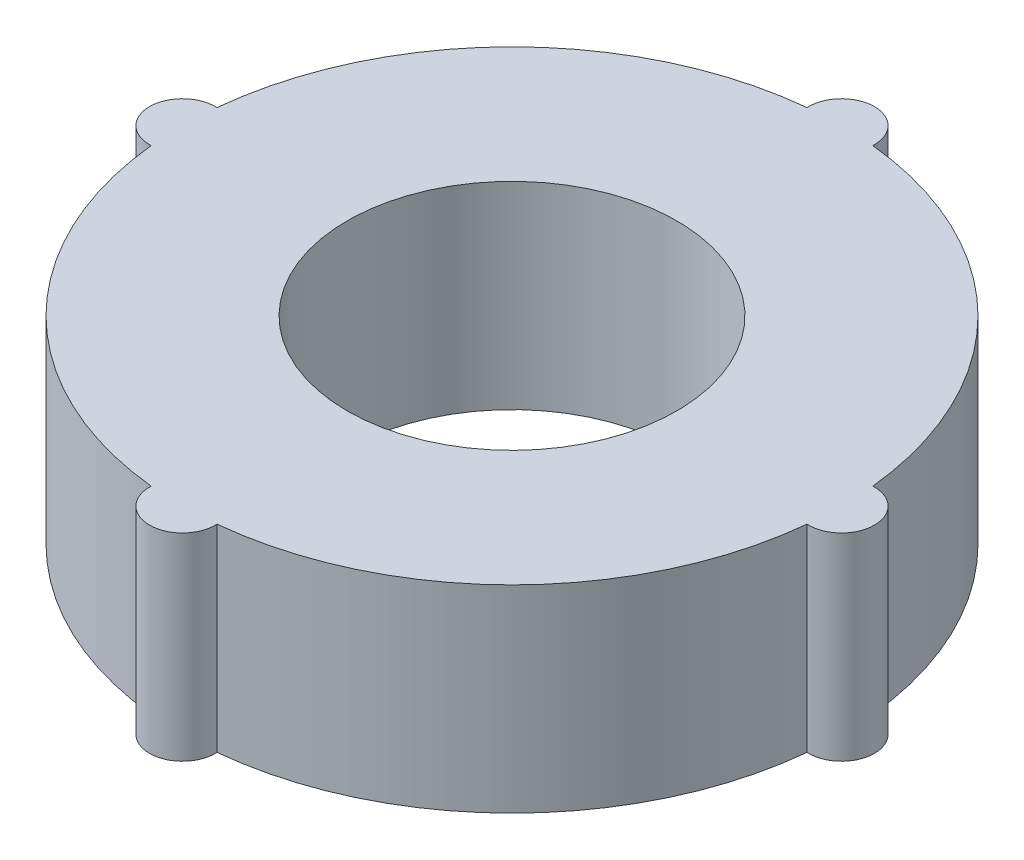
ISO-10303-21;
HEADER;
FILE_DESCRIPTION(('STEP AP214'),'2;1');
FILE_NAME('part.step','',(''),(''),'','','');
FILE_SCHEMA(('AUTOMOTIVE_DESIGN { 1 0 10303 214 1 1 1 1 }'));
ENDSEC;
DATA;
#1=APPLICATION_CONTEXT('core data for automotive mechanical design processes');
#2=APPLICATION_PROTOCOL_DEFINITION('international standard','automotive_design',2000,#1);
#3=PRODUCT_CONTEXT('',#1,'mechanical');
#4=PRODUCT('Part','Part','',(#3));
#5=PRODUCT_RELATED_PRODUCT_CATEGORY('part','',(#4));
#6=PRODUCT_DEFINITION_FORMATION('','',#4);
#7=PRODUCT_DEFINITION_CONTEXT('part definition',#1,'design');
#8=PRODUCT_DEFINITION('design','',#6,#7);
#9=PRODUCT_DEFINITION_SHAPE('','',#8);
#10=(LENGTH_UNIT() NAMED_UNIT(*) SI_UNIT(.MILLI.,.METRE.));
#11=(NAMED_UNIT(*) PLANE_ANGLE_UNIT() SI_UNIT($,.RADIAN.));
#12=(NAMED_UNIT(*) SI_UNIT($,.STERADIAN.) SOLID_ANGLE_UNIT());
#13=UNCERTAINTY_MEASURE_WITH_UNIT(LENGTH_MEASURE(1.E-05),#10,'distance_accuracy_value','');
#14=(GEOMETRIC_REPRESENTATION_CONTEXT(3) GLOBAL_UNCERTAINTY_ASSIGNED_CONTEXT((#13)) GLOBAL_UNIT_ASSIGNED_CONTEXT((#10,
#11,#12)) REPRESENTATION_CONTEXT('',''));
#15=CARTESIAN_POINT('',(0.,0.,0.));
#16=DIRECTION('',(0.,0.,1.));
#17=DIRECTION('',(1.,0.,0.));
#18=AXIS2_PLACEMENT_3D('',#15,#16,#17);
#19=CARTESIAN_POINT('',(0.,30.,25.));
#20=DIRECTION('',(0.,1.,0.));
#21=DIRECTION('',(0.,0.,1.));
#22=AXIS2_PLACEMENT_3D('',#19,#20,#21);
#23=PLANE('',#22);
#24=CARTESIAN_POINT('',(0.,30.,0.));
#25=DIRECTION('',(0.,1.,0.));
#26=DIRECTION('',(0.,0.,1.));
#27=AXIS2_PLACEMENT_3D('',#24,#25,#26);
#28=CIRCLE('',#27,50.);
#29=CARTESIAN_POINT('',(-49.75,30.,4.99374608885957));
#30=VERTEX_POINT('',#29);
#31=CARTESIAN_POINT('',(-4.99374608885957,30.,49.75));
#32=VERTEX_POINT('',#31);
#33=EDGE_CURVE('E147',#30,#32,#28,.T.);
#34=ORIENTED_EDGE('',*,*,#33,.T.);
#35=CARTESIAN_POINT('',(0.,30.,50.));
#36=DIRECTION('',(0.,1.,0.));
#37=DIRECTION('',(0.,0.,1.));
#38=AXIS2_PLACEMENT_3D('',#35,#36,#37);
#39=CIRCLE('',#38,5.00000000000002);
#40=CARTESIAN_POINT('',(4.99374608885957,30.,49.75));
#41=VERTEX_POINT('',#40);
#42=EDGE_CURVE('E95',#32,#41,#39,.T.);
#43=ORIENTED_EDGE('',*,*,#42,.T.);
#44=CARTESIAN_POINT('',(0.,30.,0.));
#45=DIRECTION('',(0.,1.,0.));
#46=DIRECTION('',(0.,0.,1.));
#47=AXIS2_PLACEMENT_3D('',#44,#45,#46);
#48=CIRCLE('',#47,50.);
#49=CARTESIAN_POINT('',(49.75,30.,4.99374608885957));
#50=VERTEX_POINT('',#49);
#51=EDGE_CURVE('E162',#41,#50,#48,.T.);
#52=ORIENTED_EDGE('',*,*,#51,.T.);
#53=CARTESIAN_POINT('',(50.,30.,0.));
#54=DIRECTION('',(0.,1.,0.));
#55=DIRECTION('',(0.,0.,1.));
#56=AXIS2_PLACEMENT_3D('',#53,#54,#55);
#57=CIRCLE('',#56,5.00000000000002);
#58=CARTESIAN_POINT('',(49.75,30.,-4.99374608885957));
#59=VERTEX_POINT('',#58);
#60=EDGE_CURVE('E175',#50,#59,#57,.T.);
#61=ORIENTED_EDGE('',*,*,#60,.T.);
#62=CARTESIAN_POINT('',(0.,30.,0.));
#63=DIRECTION('',(0.,1.,0.));
#64=DIRECTION('',(0.,0.,1.));
#65=AXIS2_PLACEMENT_3D('',#62,#63,#64);
#66=CIRCLE('',#65,50.);
#67=CARTESIAN_POINT('',(4.99374608885957,30.,-49.75));
#68=VERTEX_POINT('',#67);
#69=EDGE_CURVE('E114',#59,#68,#66,.T.);
#70=ORIENTED_EDGE('',*,*,#69,.T.);
#71=CARTESIAN_POINT('',(0.,30.,-50.));
#72=DIRECTION('',(0.,1.,0.));
#73=DIRECTION('',(0.,0.,1.));
#74=AXIS2_PLACEMENT_3D('',#71,#72,#73);
#75=CIRCLE('',#74,5.00000000000002);
#76=CARTESIAN_POINT('',(-4.99374608885955,30.,-49.75));
#77=VERTEX_POINT('',#76);
#78=EDGE_CURVE('E108',#68,#77,#75,.T.);
#79=ORIENTED_EDGE('',*,*,#78,.T.);
#80=CARTESIAN_POINT('',(0.,30.,0.));
#81=DIRECTION('',(0.,1.,0.));
#82=DIRECTION('',(0.,0.,1.));
#83=AXIS2_PLACEMENT_3D('',#80,#81,#82);
#84=CIRCLE('',#83,50.);
#85=CARTESIAN_POINT('',(-49.75,30.,-4.99374608885957));
#86=VERTEX_POINT('',#85);
#87=EDGE_CURVE('E112',#77,#86,#84,.T.);
#88=ORIENTED_EDGE('',*,*,#87,.T.);
#89=CARTESIAN_POINT('',(-50.,30.,0.));
#90=DIRECTION('',(0.,1.,0.));
#91=DIRECTION('',(0.,0.,1.));
#92=AXIS2_PLACEMENT_3D('',#89,#90,#91);
#93=CIRCLE('',#92,5.00000000000002);
#94=EDGE_CURVE('E52',#86,#30,#93,.T.);
#95=ORIENTED_EDGE('',*,*,#94,.T.);
#96=EDGE_LOOP('',(#34,#43,#52,#61,#70,#79,#88,#95));
#97=FACE_BOUND('',#96,.T.);
#98=CARTESIAN_POINT('',(0.,30.,0.));
#99=DIRECTION('',(0.,1.,0.));
#100=DIRECTION('',(0.,0.,1.));
#101=AXIS2_PLACEMENT_3D('',#98,#99,#100);
#102=CIRCLE('',#101,25.);
#103=CARTESIAN_POINT('',(0.,30.,25.));
#104=VERTEX_POINT('',#103);
#105=EDGE_CURVE('E136',#104,#104,#102,.T.);
#106=ORIENTED_EDGE('',*,*,#105,.F.);
#107=EDGE_LOOP('',(#106));
#108=FACE_BOUND('',#107,.T.);
#109=ADVANCED_FACE('F35',(#97,#108),#23,.T.);
#110=CARTESIAN_POINT('',(0.,0.,25.));
#111=DIRECTION('',(0.,1.,0.));
#112=DIRECTION('',(0.,0.,1.));
#113=AXIS2_PLACEMENT_3D('',#110,#111,#112);
#114=PLANE('',#113);
#115=CARTESIAN_POINT('',(0.,0.,0.));
#116=DIRECTION('',(0.,1.,0.));
#117=DIRECTION('',(0.,0.,1.));
#118=AXIS2_PLACEMENT_3D('',#115,#116,#117);
#119=CIRCLE('',#118,50.);
#120=CARTESIAN_POINT('',(-49.75,0.,4.99374608885957));
#121=VERTEX_POINT('',#120);
#122=CARTESIAN_POINT('',(-4.99374608885957,0.,49.75));
#123=VERTEX_POINT('',#122);
#124=EDGE_CURVE('E132',#121,#123,#119,.T.);
#125=ORIENTED_EDGE('',*,*,#124,.F.);
#126=CARTESIAN_POINT('',(-50.,0.,0.));
#127=DIRECTION('',(0.,1.,0.));
#128=DIRECTION('',(0.,0.,1.));
#129=AXIS2_PLACEMENT_3D('',#126,#127,#128);
#130=CIRCLE('',#129,5.00000000000002);
#131=CARTESIAN_POINT('',(-49.75,0.,-4.99374608885957));
#132=VERTEX_POINT('',#131);
#133=EDGE_CURVE('E87',#132,#121,#130,.T.);
#134=ORIENTED_EDGE('',*,*,#133,.F.);
#135=CARTESIAN_POINT('',(0.,0.,0.));
#136=DIRECTION('',(0.,1.,0.));
#137=DIRECTION('',(0.,0.,1.));
#138=AXIS2_PLACEMENT_3D('',#135,#136,#137);
#139=CIRCLE('',#138,50.);
#140=CARTESIAN_POINT('',(-4.99374608885955,0.,-49.75));
#141=VERTEX_POINT('',#140);
#142=EDGE_CURVE('E81',#141,#132,#139,.T.);
#143=ORIENTED_EDGE('',*,*,#142,.F.);
#144=CARTESIAN_POINT('',(0.,0.,-50.));
#145=DIRECTION('',(0.,1.,0.));
#146=DIRECTION('',(0.,0.,1.));
#147=AXIS2_PLACEMENT_3D('',#144,#145,#146);
#148=CIRCLE('',#147,5.00000000000002);
#149=CARTESIAN_POINT('',(4.99374608885957,0.,-49.75));
#150=VERTEX_POINT('',#149);
#151=EDGE_CURVE('E122',#150,#141,#148,.T.);
#152=ORIENTED_EDGE('',*,*,#151,.F.);
#153=CARTESIAN_POINT('',(0.,0.,0.));
#154=DIRECTION('',(0.,1.,0.));
#155=DIRECTION('',(0.,0.,1.));
#156=AXIS2_PLACEMENT_3D('',#153,#154,#155);
#157=CIRCLE('',#156,50.);
#158=CARTESIAN_POINT('',(49.75,0.,-4.99374608885957));
#159=VERTEX_POINT('',#158);
#160=EDGE_CURVE('E142',#159,#150,#157,.T.);
#161=ORIENTED_EDGE('',*,*,#160,.F.);
#162=CARTESIAN_POINT('',(50.,0.,0.));
#163=DIRECTION('',(0.,1.,0.));
#164=DIRECTION('',(0.,0.,1.));
#165=AXIS2_PLACEMENT_3D('',#162,#163,#164);
#166=CIRCLE('',#165,5.00000000000002);
#167=CARTESIAN_POINT('',(49.75,0.,4.99374608885957));
#168=VERTEX_POINT('',#167);
#169=EDGE_CURVE('E140',#168,#159,#166,.T.);
#170=ORIENTED_EDGE('',*,*,#169,.F.);
#171=CARTESIAN_POINT('',(0.,0.,0.));
#172=DIRECTION('',(0.,1.,0.));
#173=DIRECTION('',(0.,0.,1.));
#174=AXIS2_PLACEMENT_3D('',#171,#172,#173);
#175=CIRCLE('',#174,50.);
#176=CARTESIAN_POINT('',(4.99374608885957,0.,49.75));
#177=VERTEX_POINT('',#176);
#178=EDGE_CURVE('E138',#177,#168,#175,.T.);
#179=ORIENTED_EDGE('',*,*,#178,.F.);
#180=CARTESIAN_POINT('',(0.,0.,50.));
#181=DIRECTION('',(0.,1.,0.));
#182=DIRECTION('',(0.,0.,1.));
#183=AXIS2_PLACEMENT_3D('',#180,#181,#182);
#184=CIRCLE('',#183,5.00000000000002);
#185=EDGE_CURVE('E135',#123,#177,#184,.T.);
#186=ORIENTED_EDGE('',*,*,#185,.F.);
#187=EDGE_LOOP('',(#125,#134,#143,#152,#161,#170,#179,#186));
#188=FACE_BOUND('',#187,.T.);
#189=CARTESIAN_POINT('',(0.,0.,0.));
#190=DIRECTION('',(0.,1.,0.));
#191=DIRECTION('',(0.,0.,1.));
#192=AXIS2_PLACEMENT_3D('',#189,#190,#191);
#193=CIRCLE('',#192,25.);
#194=CARTESIAN_POINT('',(0.,0.,25.));
#195=VERTEX_POINT('',#194);
#196=EDGE_CURVE('E181',#195,#195,#193,.T.);
#197=ORIENTED_EDGE('',*,*,#196,.T.);
#198=EDGE_LOOP('',(#197));
#199=FACE_BOUND('',#198,.T.);
#200=ADVANCED_FACE('F166',(#188,#199),#114,.F.);
#201=CARTESIAN_POINT('',(0.,30.,0.));
#202=DIRECTION('',(0.,-1.,0.));
#203=DIRECTION('',(0.,0.,-1.));
#204=AXIS2_PLACEMENT_3D('',#201,#202,#203);
#205=CYLINDRICAL_SURFACE('',#204,50.);
#206=ORIENTED_EDGE('',*,*,#124,.T.);
#207=DIRECTION('',(0.,-1.,0.));
#208=VECTOR('',#207,1.);
#209=CARTESIAN_POINT('',(-4.99374608885957,30.,49.75));
#210=LINE('',#209,#208);
#211=EDGE_CURVE('E11',#32,#123,#210,.T.);
#212=ORIENTED_EDGE('',*,*,#211,.F.);
#213=ORIENTED_EDGE('',*,*,#33,.F.);
#214=DIRECTION('',(0.,-1.,0.));
#215=VECTOR('',#214,1.);
#216=CARTESIAN_POINT('',(-49.75,30.,4.99374608885957));
#217=LINE('',#216,#215);
#218=EDGE_CURVE('E128',#30,#121,#217,.T.);
#219=ORIENTED_EDGE('',*,*,#218,.T.);
#220=EDGE_LOOP('',(#206,#212,#213,#219));
#221=FACE_BOUND('',#220,.T.);
#222=ADVANCED_FACE('F37',(#221),#205,.T.);
#223=CARTESIAN_POINT('',(0.,30.,50.));
#224=DIRECTION('',(0.,-1.,0.));
#225=DIRECTION('',(0.,0.,-1.));
#226=AXIS2_PLACEMENT_3D('',#223,#224,#225);
#227=CYLINDRICAL_SURFACE('',#226,5.00000000000002);
#228=ORIENTED_EDGE('',*,*,#185,.T.);
#229=DIRECTION('',(0.,-1.,0.));
#230=VECTOR('',#229,1.);
#231=CARTESIAN_POINT('',(4.99374608885957,30.,49.75));
#232=LINE('',#231,#230);
#233=EDGE_CURVE('E44',#41,#177,#232,.T.);
#234=ORIENTED_EDGE('',*,*,#233,.F.);
#235=ORIENTED_EDGE('',*,*,#42,.F.);
#236=ORIENTED_EDGE('',*,*,#211,.T.);
#237=EDGE_LOOP('',(#228,#234,#235,#236));
#238=FACE_BOUND('',#237,.T.);
#239=ADVANCED_FACE('F209',(#238),#227,.T.);
#240=CARTESIAN_POINT('',(0.,30.,0.));
#241=DIRECTION('',(0.,-1.,0.));
#242=DIRECTION('',(0.,0.,-1.));
#243=AXIS2_PLACEMENT_3D('',#240,#241,#242);
#244=CYLINDRICAL_SURFACE('',#243,50.);
#245=ORIENTED_EDGE('',*,*,#178,.T.);
#246=DIRECTION('',(0.,-1.,0.));
#247=VECTOR('',#246,1.);
#248=CARTESIAN_POINT('',(49.75,30.,4.99374608885957));
#249=LINE('',#248,#247);
#250=EDGE_CURVE('E154',#50,#168,#249,.T.);
#251=ORIENTED_EDGE('',*,*,#250,.F.);
#252=ORIENTED_EDGE('',*,*,#51,.F.);
#253=ORIENTED_EDGE('',*,*,#233,.T.);
#254=EDGE_LOOP('',(#245,#251,#252,#253));
#255=FACE_BOUND('',#254,.T.);
#256=ADVANCED_FACE('F160',(#255),#244,.T.);
#257=CARTESIAN_POINT('',(50.,30.,0.));
#258=DIRECTION('',(0.,-1.,0.));
#259=DIRECTION('',(0.,0.,-1.));
#260=AXIS2_PLACEMENT_3D('',#257,#258,#259);
#261=CYLINDRICAL_SURFACE('',#260,5.00000000000002);
#262=ORIENTED_EDGE('',*,*,#169,.T.);
#263=DIRECTION('',(0.,-1.,0.));
#264=VECTOR('',#263,1.);
#265=CARTESIAN_POINT('',(49.75,30.,-4.99374608885957));
#266=LINE('',#265,#264);
#267=EDGE_CURVE('E151',#59,#159,#266,.T.);
#268=ORIENTED_EDGE('',*,*,#267,.F.);
#269=ORIENTED_EDGE('',*,*,#60,.F.);
#270=ORIENTED_EDGE('',*,*,#250,.T.);
#271=EDGE_LOOP('',(#262,#268,#269,#270));
#272=FACE_BOUND('',#271,.T.);
#273=ADVANCED_FACE('F171',(#272),#261,.T.);
#274=CARTESIAN_POINT('',(0.,30.,0.));
#275=DIRECTION('',(0.,-1.,0.));
#276=DIRECTION('',(0.,0.,-1.));
#277=AXIS2_PLACEMENT_3D('',#274,#275,#276);
#278=CYLINDRICAL_SURFACE('',#277,50.);
#279=ORIENTED_EDGE('',*,*,#160,.T.);
#280=DIRECTION('',(0.,-1.,0.));
#281=VECTOR('',#280,1.);
#282=CARTESIAN_POINT('',(4.99374608885957,30.,-49.75));
#283=LINE('',#282,#281);
#284=EDGE_CURVE('E123',#68,#150,#283,.T.);
#285=ORIENTED_EDGE('',*,*,#284,.F.);
#286=ORIENTED_EDGE('',*,*,#69,.F.);
#287=ORIENTED_EDGE('',*,*,#267,.T.);
#288=EDGE_LOOP('',(#279,#285,#286,#287));
#289=FACE_BOUND('',#288,.T.);
#290=ADVANCED_FACE('F174',(#289),#278,.T.);
#291=CARTESIAN_POINT('',(0.,30.,-50.));
#292=DIRECTION('',(0.,-1.,0.));
#293=DIRECTION('',(0.,0.,-1.));
#294=AXIS2_PLACEMENT_3D('',#291,#292,#293);
#295=CYLINDRICAL_SURFACE('',#294,5.00000000000002);
#296=ORIENTED_EDGE('',*,*,#151,.T.);
#297=DIRECTION('',(0.,-1.,0.));
#298=VECTOR('',#297,1.);
#299=CARTESIAN_POINT('',(-4.99374608885955,30.,-49.75));
#300=LINE('',#299,#298);
#301=EDGE_CURVE('E119',#77,#141,#300,.T.);
#302=ORIENTED_EDGE('',*,*,#301,.F.);
#303=ORIENTED_EDGE('',*,*,#78,.F.);
#304=ORIENTED_EDGE('',*,*,#284,.T.);
#305=EDGE_LOOP('',(#296,#302,#303,#304));
#306=FACE_BOUND('',#305,.T.);
#307=ADVANCED_FACE('F120',(#306),#295,.T.);
#308=CARTESIAN_POINT('',(0.,30.,0.));
#309=DIRECTION('',(0.,-1.,0.));
#310=DIRECTION('',(0.,0.,-1.));
#311=AXIS2_PLACEMENT_3D('',#308,#309,#310);
#312=CYLINDRICAL_SURFACE('',#311,50.);
#313=ORIENTED_EDGE('',*,*,#142,.T.);
#314=DIRECTION('',(0.,-1.,0.));
#315=VECTOR('',#314,1.);
#316=CARTESIAN_POINT('',(-49.75,30.,-4.99374608885957));
#317=LINE('',#316,#315);
#318=EDGE_CURVE('E124',#86,#132,#317,.T.);
#319=ORIENTED_EDGE('',*,*,#318,.F.);
#320=ORIENTED_EDGE('',*,*,#87,.F.);
#321=ORIENTED_EDGE('',*,*,#301,.T.);
#322=EDGE_LOOP('',(#313,#319,#320,#321));
#323=FACE_BOUND('',#322,.T.);
#324=ADVANCED_FACE('F126',(#323),#312,.T.);
#325=CARTESIAN_POINT('',(-50.,30.,0.));
#326=DIRECTION('',(0.,-1.,0.));
#327=DIRECTION('',(0.,0.,-1.));
#328=AXIS2_PLACEMENT_3D('',#325,#326,#327);
#329=CYLINDRICAL_SURFACE('',#328,5.00000000000002);
#330=ORIENTED_EDGE('',*,*,#133,.T.);
#331=ORIENTED_EDGE('',*,*,#218,.F.);
#332=ORIENTED_EDGE('',*,*,#94,.F.);
#333=ORIENTED_EDGE('',*,*,#318,.T.);
#334=EDGE_LOOP('',(#330,#331,#332,#333));
#335=FACE_BOUND('',#334,.T.);
#336=ADVANCED_FACE('F197',(#335),#329,.T.);
#337=CARTESIAN_POINT('',(0.,30.,0.));
#338=DIRECTION('',(0.,-1.,0.));
#339=DIRECTION('',(0.,0.,-1.));
#340=AXIS2_PLACEMENT_3D('',#337,#338,#339);
#341=CYLINDRICAL_SURFACE('',#340,25.);
#342=ORIENTED_EDGE('',*,*,#105,.T.);
#343=EDGE_LOOP('',(#342));
#344=FACE_BOUND('',#343,.T.);
#345=ORIENTED_EDGE('',*,*,#196,.F.);
#346=EDGE_LOOP('',(#345));
#347=FACE_BOUND('',#346,.T.);
#348=ADVANCED_FACE('F187',(#344,#347),#341,.F.);
#349=CLOSED_SHELL('',(#109,#200,#222,#239,#256,#273,#290,#307,#324,#336,#348));
#350=MANIFOLD_SOLID_BREP('B2',#349);
#351=ADVANCED_BREP_SHAPE_REPRESENTATION('',(#18,#350),#14);
#352=SHAPE_DEFINITION_REPRESENTATION(#9,#351);
ENDSEC;
END-ISO-10303-21;
